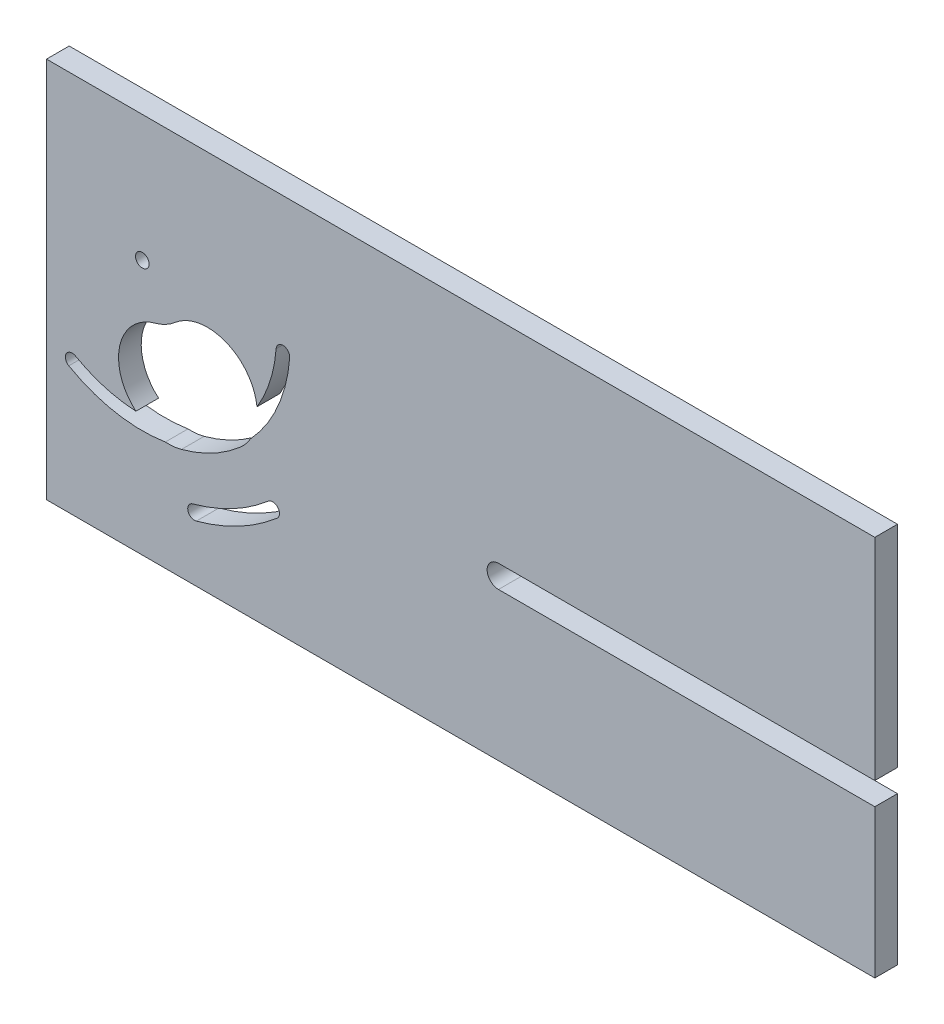
ISO-10303-21;
HEADER;
FILE_DESCRIPTION(('STEP AP214'),'2;1');
FILE_NAME('part.step','',(''),(''),'','','');
FILE_SCHEMA(('AUTOMOTIVE_DESIGN { 1 0 10303 214 1 1 1 1 }'));
ENDSEC;
DATA;
#1=APPLICATION_CONTEXT('core data for automotive mechanical design processes');
#2=APPLICATION_PROTOCOL_DEFINITION('international standard','automotive_design',2000,#1);
#3=PRODUCT_CONTEXT('',#1,'mechanical');
#4=PRODUCT('Part','Part','',(#3));
#5=PRODUCT_RELATED_PRODUCT_CATEGORY('part','',(#4));
#6=PRODUCT_DEFINITION_FORMATION('','',#4);
#7=PRODUCT_DEFINITION_CONTEXT('part definition',#1,'design');
#8=PRODUCT_DEFINITION('design','',#6,#7);
#9=PRODUCT_DEFINITION_SHAPE('','',#8);
#10=(LENGTH_UNIT() NAMED_UNIT(*) SI_UNIT(.MILLI.,.METRE.));
#11=(NAMED_UNIT(*) PLANE_ANGLE_UNIT() SI_UNIT($,.RADIAN.));
#12=(NAMED_UNIT(*) SI_UNIT($,.STERADIAN.) SOLID_ANGLE_UNIT());
#13=UNCERTAINTY_MEASURE_WITH_UNIT(LENGTH_MEASURE(1.E-05),#10,'distance_accuracy_value','');
#14=(GEOMETRIC_REPRESENTATION_CONTEXT(3) GLOBAL_UNCERTAINTY_ASSIGNED_CONTEXT((#13)) GLOBAL_UNIT_ASSIGNED_CONTEXT((#10,
#11,#12)) REPRESENTATION_CONTEXT('',''));
#15=CARTESIAN_POINT('',(0.,0.,0.));
#16=DIRECTION('',(0.,0.,1.));
#17=DIRECTION('',(1.,0.,0.));
#18=AXIS2_PLACEMENT_3D('',#15,#16,#17);
#19=CARTESIAN_POINT('',(8.34305319938463,-6.87375629455253,5.));
#20=DIRECTION('',(0.,0.,-1.));
#21=DIRECTION('',(-1.,0.,0.));
#22=AXIS2_PLACEMENT_3D('',#19,#20,#21);
#23=CYLINDRICAL_SURFACE('',#22,2.5);
#24=CARTESIAN_POINT('',(8.34305319938463,-6.87375629455253,0.));
#25=DIRECTION('',(0.,0.,1.));
#26=DIRECTION('',(1.,0.,0.));
#27=AXIS2_PLACEMENT_3D('',#24,#25,#26);
#28=CIRCLE('',#27,2.5);
#29=CARTESIAN_POINT('',(8.34305319938463,-4.37375629455253,0.));
#30=VERTEX_POINT('',#29);
#31=CARTESIAN_POINT('',(8.34305319938463,-9.37375629455253,0.));
#32=VERTEX_POINT('',#31);
#33=EDGE_CURVE('E335',#30,#32,#28,.T.);
#34=ORIENTED_EDGE('',*,*,#33,.F.);
#35=DIRECTION('',(0.,0.,-1.));
#36=VECTOR('',#35,1.);
#37=CARTESIAN_POINT('',(8.34305319938463,-4.37375629455253,5.));
#38=LINE('',#37,#36);
#39=CARTESIAN_POINT('',(8.34305319938463,-4.37375629455253,5.));
#40=VERTEX_POINT('',#39);
#41=EDGE_CURVE('E11',#40,#30,#38,.T.);
#42=ORIENTED_EDGE('',*,*,#41,.F.);
#43=CARTESIAN_POINT('',(8.34305319938463,-6.87375629455253,5.));
#44=DIRECTION('',(0.,0.,1.));
#45=DIRECTION('',(1.,0.,0.));
#46=AXIS2_PLACEMENT_3D('',#43,#44,#45);
#47=CIRCLE('',#46,2.5);
#48=CARTESIAN_POINT('',(8.34305319938463,-9.37375629455253,5.));
#49=VERTEX_POINT('',#48);
#50=EDGE_CURVE('E398',#40,#49,#47,.T.);
#51=ORIENTED_EDGE('',*,*,#50,.T.);
#52=DIRECTION('',(0.,0.,-1.));
#53=VECTOR('',#52,1.);
#54=CARTESIAN_POINT('',(8.34305319938463,-9.37375629455253,5.));
#55=LINE('',#54,#53);
#56=EDGE_CURVE('E56',#49,#32,#55,.T.);
#57=ORIENTED_EDGE('',*,*,#56,.T.);
#58=EDGE_LOOP('',(#34,#42,#51,#57));
#59=FACE_BOUND('',#58,.T.);
#60=ADVANCED_FACE('F37',(#59),#23,.F.);
#61=CARTESIAN_POINT('',(0.,-4.37375629455253,5.));
#62=DIRECTION('',(0.,1.,0.));
#63=DIRECTION('',(-1.,0.,0.));
#64=AXIS2_PLACEMENT_3D('',#61,#62,#63);
#65=PLANE('',#64);
#66=DIRECTION('',(1.,0.,0.));
#67=VECTOR('',#66,1.);
#68=CARTESIAN_POINT('',(0.,-4.37375629455253,0.));
#69=LINE('',#68,#67);
#70=CARTESIAN_POINT('',(91.35,-4.37375629455253,0.));
#71=VERTEX_POINT('',#70);
#72=EDGE_CURVE('E337',#30,#71,#69,.T.);
#73=ORIENTED_EDGE('',*,*,#72,.T.);
#74=DIRECTION('',(0.,0.,-1.));
#75=VECTOR('',#74,1.);
#76=CARTESIAN_POINT('',(91.35,-4.37375629455253,5.));
#77=LINE('',#76,#75);
#78=CARTESIAN_POINT('',(91.35,-4.37375629455253,5.));
#79=VERTEX_POINT('',#78);
#80=EDGE_CURVE('E47',#79,#71,#77,.T.);
#81=ORIENTED_EDGE('',*,*,#80,.F.);
#82=DIRECTION('',(1.,0.,0.));
#83=VECTOR('',#82,1.);
#84=CARTESIAN_POINT('',(0.,-4.37375629455253,5.));
#85=LINE('',#84,#83);
#86=EDGE_CURVE('E400',#40,#79,#85,.T.);
#87=ORIENTED_EDGE('',*,*,#86,.F.);
#88=ORIENTED_EDGE('',*,*,#41,.T.);
#89=EDGE_LOOP('',(#73,#81,#87,#88));
#90=FACE_BOUND('',#89,.T.);
#91=ADVANCED_FACE('F424',(#90),#65,.F.);
#92=CARTESIAN_POINT('',(91.35,0.,5.));
#93=DIRECTION('',(-1.,0.,0.));
#94=DIRECTION('',(0.,0.,1.));
#95=AXIS2_PLACEMENT_3D('',#92,#93,#94);
#96=PLANE('',#95);
#97=DIRECTION('',(0.,1.,0.));
#98=VECTOR('',#97,1.);
#99=CARTESIAN_POINT('',(91.35,0.,0.));
#100=LINE('',#99,#98);
#101=CARTESIAN_POINT('',(91.35,42.09,0.));
#102=VERTEX_POINT('',#101);
#103=EDGE_CURVE('E340',#71,#102,#100,.T.);
#104=ORIENTED_EDGE('',*,*,#103,.T.);
#105=DIRECTION('',(0.,0.,-1.));
#106=VECTOR('',#105,1.);
#107=CARTESIAN_POINT('',(91.35,42.09,5.));
#108=LINE('',#107,#106);
#109=CARTESIAN_POINT('',(91.35,42.09,5.));
#110=VERTEX_POINT('',#109);
#111=EDGE_CURVE('E238',#110,#102,#108,.T.);
#112=ORIENTED_EDGE('',*,*,#111,.F.);
#113=DIRECTION('',(0.,1.,0.));
#114=VECTOR('',#113,1.);
#115=CARTESIAN_POINT('',(91.35,0.,5.));
#116=LINE('',#115,#114);
#117=EDGE_CURVE('E216',#79,#110,#116,.T.);
#118=ORIENTED_EDGE('',*,*,#117,.F.);
#119=ORIENTED_EDGE('',*,*,#80,.T.);
#120=EDGE_LOOP('',(#104,#112,#118,#119));
#121=FACE_BOUND('',#120,.T.);
#122=ADVANCED_FACE('F429',(#121),#96,.F.);
#123=CARTESIAN_POINT('',(0.,42.09,5.));
#124=DIRECTION('',(0.,1.,0.));
#125=DIRECTION('',(0.,0.,1.));
#126=AXIS2_PLACEMENT_3D('',#123,#124,#125);
#127=PLANE('',#126);
#128=DIRECTION('',(1.,0.,0.));
#129=VECTOR('',#128,1.);
#130=CARTESIAN_POINT('',(0.,42.09,0.));
#131=LINE('',#130,#129);
#132=CARTESIAN_POINT('',(-91.35,42.09,0.));
#133=VERTEX_POINT('',#132);
#134=EDGE_CURVE('E343',#133,#102,#131,.T.);
#135=ORIENTED_EDGE('',*,*,#134,.F.);
#136=DIRECTION('',(0.,0.,-1.));
#137=VECTOR('',#136,1.);
#138=CARTESIAN_POINT('',(-91.35,42.09,5.));
#139=LINE('',#138,#137);
#140=CARTESIAN_POINT('',(-91.35,42.09,5.));
#141=VERTEX_POINT('',#140);
#142=EDGE_CURVE('E232',#141,#133,#139,.T.);
#143=ORIENTED_EDGE('',*,*,#142,.F.);
#144=DIRECTION('',(1.,0.,0.));
#145=VECTOR('',#144,1.);
#146=CARTESIAN_POINT('',(0.,42.09,5.));
#147=LINE('',#146,#145);
#148=EDGE_CURVE('E403',#141,#110,#147,.T.);
#149=ORIENTED_EDGE('',*,*,#148,.T.);
#150=ORIENTED_EDGE('',*,*,#111,.T.);
#151=EDGE_LOOP('',(#135,#143,#149,#150));
#152=FACE_BOUND('',#151,.T.);
#153=ADVANCED_FACE('F525',(#152),#127,.T.);
#154=CARTESIAN_POINT('',(-91.35,0.,5.));
#155=DIRECTION('',(-1.,0.,0.));
#156=DIRECTION('',(0.,0.,1.));
#157=AXIS2_PLACEMENT_3D('',#154,#155,#156);
#158=PLANE('',#157);
#159=DIRECTION('',(0.,1.,0.));
#160=VECTOR('',#159,1.);
#161=CARTESIAN_POINT('',(-91.35,0.,0.));
#162=LINE('',#161,#160);
#163=CARTESIAN_POINT('',(-91.35,-42.09,0.));
#164=VERTEX_POINT('',#163);
#165=EDGE_CURVE('E347',#164,#133,#162,.T.);
#166=ORIENTED_EDGE('',*,*,#165,.F.);
#167=DIRECTION('',(0.,0.,-1.));
#168=VECTOR('',#167,1.);
#169=CARTESIAN_POINT('',(-91.35,-42.09,5.));
#170=LINE('',#169,#168);
#171=CARTESIAN_POINT('',(-91.35,-42.09,5.));
#172=VERTEX_POINT('',#171);
#173=EDGE_CURVE('E230',#172,#164,#170,.T.);
#174=ORIENTED_EDGE('',*,*,#173,.F.);
#175=DIRECTION('',(0.,1.,0.));
#176=VECTOR('',#175,1.);
#177=CARTESIAN_POINT('',(-91.35,0.,5.));
#178=LINE('',#177,#176);
#179=EDGE_CURVE('E224',#172,#141,#178,.T.);
#180=ORIENTED_EDGE('',*,*,#179,.T.);
#181=ORIENTED_EDGE('',*,*,#142,.T.);
#182=EDGE_LOOP('',(#166,#174,#180,#181));
#183=FACE_BOUND('',#182,.T.);
#184=ADVANCED_FACE('F518',(#183),#158,.T.);
#185=CARTESIAN_POINT('',(0.,-42.09,5.));
#186=DIRECTION('',(0.,1.,0.));
#187=DIRECTION('',(0.,0.,1.));
#188=AXIS2_PLACEMENT_3D('',#185,#186,#187);
#189=PLANE('',#188);
#190=DIRECTION('',(1.,0.,0.));
#191=VECTOR('',#190,1.);
#192=CARTESIAN_POINT('',(0.,-42.09,0.));
#193=LINE('',#192,#191);
#194=CARTESIAN_POINT('',(91.35,-42.09,0.));
#195=VERTEX_POINT('',#194);
#196=EDGE_CURVE('E229',#164,#195,#193,.T.);
#197=ORIENTED_EDGE('',*,*,#196,.T.);
#198=DIRECTION('',(0.,0.,-1.));
#199=VECTOR('',#198,1.);
#200=CARTESIAN_POINT('',(91.35,-42.09,5.));
#201=LINE('',#200,#199);
#202=CARTESIAN_POINT('',(91.35,-42.09,5.));
#203=VERTEX_POINT('',#202);
#204=EDGE_CURVE('E209',#203,#195,#201,.T.);
#205=ORIENTED_EDGE('',*,*,#204,.F.);
#206=DIRECTION('',(1.,0.,0.));
#207=VECTOR('',#206,1.);
#208=CARTESIAN_POINT('',(0.,-42.09,5.));
#209=LINE('',#208,#207);
#210=EDGE_CURVE('E214',#172,#203,#209,.T.);
#211=ORIENTED_EDGE('',*,*,#210,.F.);
#212=ORIENTED_EDGE('',*,*,#173,.T.);
#213=EDGE_LOOP('',(#197,#205,#211,#212));
#214=FACE_BOUND('',#213,.T.);
#215=ADVANCED_FACE('F227',(#214),#189,.F.);
#216=CARTESIAN_POINT('',(91.35,-9.37375629455253,0.));
#217=VERTEX_POINT('',#216);
#218=EDGE_CURVE('E344',#195,#217,#100,.T.);
#219=ORIENTED_EDGE('',*,*,#218,.T.);
#220=DIRECTION('',(0.,0.,-1.));
#221=VECTOR('',#220,1.);
#222=CARTESIAN_POINT('',(91.35,-9.37375629455253,5.));
#223=LINE('',#222,#221);
#224=CARTESIAN_POINT('',(91.35,-9.37375629455253,5.));
#225=VERTEX_POINT('',#224);
#226=EDGE_CURVE('E130',#225,#217,#223,.T.);
#227=ORIENTED_EDGE('',*,*,#226,.F.);
#228=EDGE_CURVE('E205',#203,#225,#116,.T.);
#229=ORIENTED_EDGE('',*,*,#228,.F.);
#230=ORIENTED_EDGE('',*,*,#204,.T.);
#231=EDGE_LOOP('',(#219,#227,#229,#230));
#232=FACE_BOUND('',#231,.T.);
#233=ADVANCED_FACE('F207',(#232),#96,.F.);
#234=CARTESIAN_POINT('',(-58.7017747285603,-28.1953691451832,5.));
#235=DIRECTION('',(0.,0.,-1.));
#236=DIRECTION('',(-1.,0.,0.));
#237=AXIS2_PLACEMENT_3D('',#234,#235,#236);
#238=CYLINDRICAL_SURFACE('',#237,1.49999999999994);
#239=CARTESIAN_POINT('',(-58.7017747285603,-28.1953691451832,0.));
#240=DIRECTION('',(0.,0.,1.));
#241=DIRECTION('',(1.,0.,0.));
#242=AXIS2_PLACEMENT_3D('',#239,#240,#241);
#243=CIRCLE('',#242,1.49999999999994);
#244=CARTESIAN_POINT('',(-59.0947234892787,-26.7477534256465,0.));
#245=VERTEX_POINT('',#244);
#246=CARTESIAN_POINT('',(-58.3088259678419,-29.64298486472,0.));
#247=VERTEX_POINT('',#246);
#248=EDGE_CURVE('E323',#245,#247,#243,.T.);
#249=ORIENTED_EDGE('',*,*,#248,.F.);
#250=DIRECTION('',(0.,0.,-1.));
#251=VECTOR('',#250,1.);
#252=CARTESIAN_POINT('',(-59.0947234892787,-26.7477534256465,5.));
#253=LINE('',#252,#251);
#254=CARTESIAN_POINT('',(-59.0947234892787,-26.7477534256465,5.));
#255=VERTEX_POINT('',#254);
#256=EDGE_CURVE('E248',#255,#245,#253,.T.);
#257=ORIENTED_EDGE('',*,*,#256,.F.);
#258=CARTESIAN_POINT('',(-58.7017747285603,-28.1953691451832,5.));
#259=DIRECTION('',(0.,0.,1.));
#260=DIRECTION('',(1.,0.,0.));
#261=AXIS2_PLACEMENT_3D('',#258,#259,#260);
#262=CIRCLE('',#261,1.49999999999994);
#263=CARTESIAN_POINT('',(-58.3088259678419,-29.64298486472,5.));
#264=VERTEX_POINT('',#263);
#265=EDGE_CURVE('E387',#255,#264,#262,.T.);
#266=ORIENTED_EDGE('',*,*,#265,.T.);
#267=DIRECTION('',(0.,0.,-1.));
#268=VECTOR('',#267,1.);
#269=CARTESIAN_POINT('',(-58.3088259678419,-29.64298486472,5.));
#270=LINE('',#269,#268);
#271=EDGE_CURVE('E242',#264,#247,#270,.T.);
#272=ORIENTED_EDGE('',*,*,#271,.T.);
#273=EDGE_LOOP('',(#249,#257,#266,#272));
#274=FACE_BOUND('',#273,.T.);
#275=ADVANCED_FACE('F446',(#274),#238,.F.);
#276=CARTESIAN_POINT('',(-70.2235672720057,14.2506942363108,5.));
#277=DIRECTION('',(0.,0.,-1.));
#278=DIRECTION('',(-1.,0.,0.));
#279=AXIS2_PLACEMENT_3D('',#276,#277,#278);
#280=CYLINDRICAL_SURFACE('',#279,42.4820417898032);
#281=CARTESIAN_POINT('',(-70.2235672720057,14.2506942363108,0.));
#282=DIRECTION('',(0.,0.,1.));
#283=DIRECTION('',(1.,0.,0.));
#284=AXIS2_PLACEMENT_3D('',#281,#282,#283);
#285=CIRCLE('',#284,42.4820417898032);
#286=CARTESIAN_POINT('',(-42.4512097179492,-17.8961567839715,0.));
#287=VERTEX_POINT('',#286);
#288=EDGE_CURVE('E326',#245,#287,#285,.T.);
#289=ORIENTED_EDGE('',*,*,#288,.T.);
#290=DIRECTION('',(0.,0.,-1.));
#291=VECTOR('',#290,1.);
#292=CARTESIAN_POINT('',(-42.4512097179492,-17.8961567839715,5.));
#293=LINE('',#292,#291);
#294=CARTESIAN_POINT('',(-42.4512097179492,-17.8961567839715,5.));
#295=VERTEX_POINT('',#294);
#296=EDGE_CURVE('E246',#295,#287,#293,.T.);
#297=ORIENTED_EDGE('',*,*,#296,.F.);
#298=CARTESIAN_POINT('',(-70.2235672720057,14.2506942363108,5.));
#299=DIRECTION('',(0.,0.,1.));
#300=DIRECTION('',(1.,0.,0.));
#301=AXIS2_PLACEMENT_3D('',#298,#299,#300);
#302=CIRCLE('',#301,42.4820417898032);
#303=EDGE_CURVE('E390',#255,#295,#302,.T.);
#304=ORIENTED_EDGE('',*,*,#303,.F.);
#305=ORIENTED_EDGE('',*,*,#256,.T.);
#306=EDGE_LOOP('',(#289,#297,#304,#305));
#307=FACE_BOUND('',#306,.T.);
#308=ADVANCED_FACE('F442',(#307),#280,.T.);
#309=CARTESIAN_POINT('',(-41.4705945079456,-19.0312311471345,5.));
#310=DIRECTION('',(0.,0.,-1.));
#311=DIRECTION('',(-1.,0.,0.));
#312=AXIS2_PLACEMENT_3D('',#309,#310,#311);
#313=CYLINDRICAL_SURFACE('',#312,1.5);
#314=CARTESIAN_POINT('',(-41.4705945079456,-19.0312311471345,0.));
#315=DIRECTION('',(0.,0.,1.));
#316=DIRECTION('',(1.,0.,0.));
#317=AXIS2_PLACEMENT_3D('',#314,#315,#316);
#318=CIRCLE('',#317,1.5);
#319=CARTESIAN_POINT('',(-40.4899792979421,-20.1663055102974,0.));
#320=VERTEX_POINT('',#319);
#321=EDGE_CURVE('E329',#320,#287,#318,.T.);
#322=ORIENTED_EDGE('',*,*,#321,.F.);
#323=DIRECTION('',(0.,0.,-1.));
#324=VECTOR('',#323,1.);
#325=CARTESIAN_POINT('',(-40.4899792979421,-20.1663055102974,5.));
#326=LINE('',#325,#324);
#327=CARTESIAN_POINT('',(-40.4899792979421,-20.1663055102974,5.));
#328=VERTEX_POINT('',#327);
#329=EDGE_CURVE('E244',#328,#320,#326,.T.);
#330=ORIENTED_EDGE('',*,*,#329,.F.);
#331=CARTESIAN_POINT('',(-41.4705945079456,-19.0312311471345,5.));
#332=DIRECTION('',(0.,0.,1.));
#333=DIRECTION('',(1.,0.,0.));
#334=AXIS2_PLACEMENT_3D('',#331,#332,#333);
#335=CIRCLE('',#334,1.5);
#336=EDGE_CURVE('E392',#328,#295,#335,.T.);
#337=ORIENTED_EDGE('',*,*,#336,.T.);
#338=ORIENTED_EDGE('',*,*,#296,.T.);
#339=EDGE_LOOP('',(#322,#330,#337,#338));
#340=FACE_BOUND('',#339,.T.);
#341=ADVANCED_FACE('F439',(#340),#313,.F.);
#342=CARTESIAN_POINT('',(-64.462671000283,-6.97233745443623,5.));
#343=DIRECTION('',(0.,0.,-1.));
#344=DIRECTION('',(-1.,0.,0.));
#345=AXIS2_PLACEMENT_3D('',#342,#343,#344);
#346=CYLINDRICAL_SURFACE('',#345,11.);
#347=CARTESIAN_POINT('',(-64.462671000283,-6.97233745443623,0.));
#348=DIRECTION('',(0.,0.,1.));
#349=DIRECTION('',(1.,0.,0.));
#350=AXIS2_PLACEMENT_3D('',#347,#348,#349);
#351=CIRCLE('',#350,11.);
#352=CARTESIAN_POINT('',(-65.144358521498,-17.9511945043946,0.));
#353=VERTEX_POINT('',#352);
#354=CARTESIAN_POINT('',(-61.5810467550147,-17.5881860643723,0.));
#355=VERTEX_POINT('',#354);
#356=EDGE_CURVE('E286',#353,#355,#351,.T.);
#357=ORIENTED_EDGE('',*,*,#356,.F.);
#358=DIRECTION('',(0.,0.,-1.));
#359=VECTOR('',#358,1.);
#360=CARTESIAN_POINT('',(-65.144358521498,-17.9511945043946,5.));
#361=LINE('',#360,#359);
#362=CARTESIAN_POINT('',(-65.144358521498,-17.9511945043946,5.));
#363=VERTEX_POINT('',#362);
#364=EDGE_CURVE('E41',#363,#353,#361,.T.);
#365=ORIENTED_EDGE('',*,*,#364,.F.);
#366=CARTESIAN_POINT('',(-64.462671000283,-6.97233745443623,5.));
#367=DIRECTION('',(0.,0.,1.));
#368=DIRECTION('',(1.,0.,0.));
#369=AXIS2_PLACEMENT_3D('',#366,#367,#368);
#370=CIRCLE('',#369,11.);
#371=CARTESIAN_POINT('',(-61.5810467550147,-17.5881860643723,5.));
#372=VERTEX_POINT('',#371);
#373=EDGE_CURVE('E356',#363,#372,#370,.T.);
#374=ORIENTED_EDGE('',*,*,#373,.T.);
#375=DIRECTION('',(0.,0.,-1.));
#376=VECTOR('',#375,1.);
#377=CARTESIAN_POINT('',(-61.5810467550147,-17.5881860643723,5.));
#378=LINE('',#377,#376);
#379=EDGE_CURVE('E250',#372,#355,#378,.T.);
#380=ORIENTED_EDGE('',*,*,#379,.T.);
#381=EDGE_LOOP('',(#357,#365,#374,#380));
#382=FACE_BOUND('',#381,.T.);
#383=ADVANCED_FACE('F39',(#382),#346,.F.);
#384=CARTESIAN_POINT('',(-70.2235672720057,14.2506942363108,5.));
#385=DIRECTION('',(0.,0.,-1.));
#386=DIRECTION('',(-1.,0.,0.));
#387=AXIS2_PLACEMENT_3D('',#384,#385,#386);
#388=CYLINDRICAL_SURFACE('',#387,32.6);
#389=CARTESIAN_POINT('',(-70.2235672720057,14.2506942363108,0.));
#390=DIRECTION('',(0.,0.,1.));
#391=DIRECTION('',(1.,0.,0.));
#392=AXIS2_PLACEMENT_3D('',#389,#390,#391);
#393=CIRCLE('',#392,32.6);
#394=CARTESIAN_POINT('',(-86.4314648495039,-14.0347093513584,0.));
#395=VERTEX_POINT('',#394);
#396=EDGE_CURVE('E281',#395,#353,#393,.T.);
#397=ORIENTED_EDGE('',*,*,#396,.F.);
#398=DIRECTION('',(0.,0.,-1.));
#399=VECTOR('',#398,1.);
#400=CARTESIAN_POINT('',(-86.4314648495039,-14.0347093513584,5.));
#401=LINE('',#400,#399);
#402=CARTESIAN_POINT('',(-86.4314648495039,-14.0347093513584,5.));
#403=VERTEX_POINT('',#402);
#404=EDGE_CURVE('E272',#403,#395,#401,.T.);
#405=ORIENTED_EDGE('',*,*,#404,.F.);
#406=CARTESIAN_POINT('',(-70.2235672720057,14.2506942363108,5.));
#407=DIRECTION('',(0.,0.,1.));
#408=DIRECTION('',(1.,0.,0.));
#409=AXIS2_PLACEMENT_3D('',#406,#407,#408);
#410=CIRCLE('',#409,32.6);
#411=EDGE_CURVE('E284',#403,#363,#410,.T.);
#412=ORIENTED_EDGE('',*,*,#411,.T.);
#413=ORIENTED_EDGE('',*,*,#364,.T.);
#414=EDGE_LOOP('',(#397,#405,#412,#413));
#415=FACE_BOUND('',#414,.T.);
#416=ADVANCED_FACE('F279',(#415),#388,.F.);
#417=CARTESIAN_POINT('',(-85.6857026910301,-12.7332337261589,5.));
#418=DIRECTION('',(0.,0.,-1.));
#419=DIRECTION('',(-1.,0.,0.));
#420=AXIS2_PLACEMENT_3D('',#417,#418,#419);
#421=CYLINDRICAL_SURFACE('',#420,1.49999999999997);
#422=CARTESIAN_POINT('',(-85.6857026910301,-12.7332337261589,0.));
#423=DIRECTION('',(0.,0.,1.));
#424=DIRECTION('',(1.,0.,0.));
#425=AXIS2_PLACEMENT_3D('',#422,#423,#424);
#426=CIRCLE('',#425,1.49999999999997);
#427=CARTESIAN_POINT('',(-84.9399405325562,-11.4317581009594,0.));
#428=VERTEX_POINT('',#427);
#429=EDGE_CURVE('E294',#428,#395,#426,.T.);
#430=ORIENTED_EDGE('',*,*,#429,.F.);
#431=DIRECTION('',(0.,0.,-1.));
#432=VECTOR('',#431,1.);
#433=CARTESIAN_POINT('',(-84.9399405325562,-11.4317581009594,5.));
#434=LINE('',#433,#432);
#435=CARTESIAN_POINT('',(-84.9399405325562,-11.4317581009594,5.));
#436=VERTEX_POINT('',#435);
#437=EDGE_CURVE('E271',#436,#428,#434,.T.);
#438=ORIENTED_EDGE('',*,*,#437,.F.);
#439=CARTESIAN_POINT('',(-85.6857026910301,-12.7332337261589,5.));
#440=DIRECTION('',(0.,0.,1.));
#441=DIRECTION('',(1.,0.,0.));
#442=AXIS2_PLACEMENT_3D('',#439,#440,#441);
#443=CIRCLE('',#442,1.49999999999997);
#444=EDGE_CURVE('E361',#436,#403,#443,.T.);
#445=ORIENTED_EDGE('',*,*,#444,.T.);
#446=ORIENTED_EDGE('',*,*,#404,.T.);
#447=EDGE_LOOP('',(#430,#438,#445,#446));
#448=FACE_BOUND('',#447,.T.);
#449=ADVANCED_FACE('F485',(#448),#421,.F.);
#450=CARTESIAN_POINT('',(-70.2235672720057,14.2506942363108,5.));
#451=DIRECTION('',(0.,0.,-1.));
#452=DIRECTION('',(-1.,0.,0.));
#453=AXIS2_PLACEMENT_3D('',#450,#451,#452);
#454=CYLINDRICAL_SURFACE('',#453,29.6);
#455=CARTESIAN_POINT('',(-70.2235672720057,14.2506942363108,0.));
#456=DIRECTION('',(0.,0.,1.));
#457=DIRECTION('',(1.,0.,0.));
#458=AXIS2_PLACEMENT_3D('',#455,#456,#457);
#459=CIRCLE('',#458,29.6);
#460=CARTESIAN_POINT('',(-71.6310926148158,-15.3158218318591,0.));
#461=VERTEX_POINT('',#460);
#462=EDGE_CURVE('E296',#428,#461,#459,.T.);
#463=ORIENTED_EDGE('',*,*,#462,.T.);
#464=DIRECTION('',(0.,0.,-1.));
#465=VECTOR('',#464,1.);
#466=CARTESIAN_POINT('',(-71.6310926148158,-15.3158218318591,5.));
#467=LINE('',#466,#465);
#468=CARTESIAN_POINT('',(-71.6310926148158,-15.3158218318591,5.));
#469=VERTEX_POINT('',#468);
#470=EDGE_CURVE('E269',#469,#461,#467,.T.);
#471=ORIENTED_EDGE('',*,*,#470,.F.);
#472=CARTESIAN_POINT('',(-70.2235672720057,14.2506942363108,5.));
#473=DIRECTION('',(0.,0.,1.));
#474=DIRECTION('',(1.,0.,0.));
#475=AXIS2_PLACEMENT_3D('',#472,#473,#474);
#476=CIRCLE('',#475,29.6);
#477=EDGE_CURVE('E365',#436,#469,#476,.T.);
#478=ORIENTED_EDGE('',*,*,#477,.F.);
#479=ORIENTED_EDGE('',*,*,#437,.T.);
#480=EDGE_LOOP('',(#463,#471,#478,#479));
#481=FACE_BOUND('',#480,.T.);
#482=ADVANCED_FACE('F481',(#481),#454,.T.);
#483=CARTESIAN_POINT('',(-64.462671000283,-6.97233745443623,5.));
#484=DIRECTION('',(0.,0.,-1.));
#485=DIRECTION('',(-1.,0.,0.));
#486=AXIS2_PLACEMENT_3D('',#483,#484,#485);
#487=CYLINDRICAL_SURFACE('',#486,11.);
#488=CARTESIAN_POINT('',(-64.462671000283,-6.97233745443623,0.));
#489=DIRECTION('',(0.,0.,1.));
#490=DIRECTION('',(1.,0.,0.));
#491=AXIS2_PLACEMENT_3D('',#488,#489,#490);
#492=CIRCLE('',#491,11.);
#493=CARTESIAN_POINT('',(-67.3442952455513,3.64351115549986,0.));
#494=VERTEX_POINT('',#493);
#495=EDGE_CURVE('E302',#494,#461,#492,.T.);
#496=ORIENTED_EDGE('',*,*,#495,.F.);
#497=DIRECTION('',(0.,0.,-1.));
#498=VECTOR('',#497,1.);
#499=CARTESIAN_POINT('',(-67.3442952455513,3.64351115549986,5.));
#500=LINE('',#499,#498);
#501=CARTESIAN_POINT('',(-67.3442952455513,3.64351115549986,5.));
#502=VERTEX_POINT('',#501);
#503=EDGE_CURVE('E267',#502,#494,#500,.T.);
#504=ORIENTED_EDGE('',*,*,#503,.F.);
#505=CARTESIAN_POINT('',(-64.462671000283,-6.97233745443623,5.));
#506=DIRECTION('',(0.,0.,1.));
#507=DIRECTION('',(1.,0.,0.));
#508=AXIS2_PLACEMENT_3D('',#505,#506,#507);
#509=CIRCLE('',#508,11.);
#510=EDGE_CURVE('E367',#502,#469,#509,.T.);
#511=ORIENTED_EDGE('',*,*,#510,.T.);
#512=ORIENTED_EDGE('',*,*,#470,.T.);
#513=EDGE_LOOP('',(#496,#504,#511,#512));
#514=FACE_BOUND('',#513,.T.);
#515=ADVANCED_FACE('F477',(#514),#487,.F.);
#516=CARTESIAN_POINT('',(-70.2235672720057,14.2506942363108,5.));
#517=DIRECTION('',(0.,0.,-1.));
#518=DIRECTION('',(-1.,0.,0.));
#519=AXIS2_PLACEMENT_3D('',#516,#517,#518);
#520=CYLINDRICAL_SURFACE('',#519,10.9910208949016);
#521=CARTESIAN_POINT('',(-70.2235672720057,14.2506942363108,0.));
#522=DIRECTION('',(0.,0.,1.));
#523=DIRECTION('',(1.,0.,0.));
#524=AXIS2_PLACEMENT_3D('',#521,#522,#523);
#525=CIRCLE('',#524,10.9910208949016);
#526=CARTESIAN_POINT('',(-63.0382590966679,5.93361020778323,0.));
#527=VERTEX_POINT('',#526);
#528=EDGE_CURVE('E305',#494,#527,#525,.T.);
#529=ORIENTED_EDGE('',*,*,#528,.T.);
#530=DIRECTION('',(0.,0.,-1.));
#531=VECTOR('',#530,1.);
#532=CARTESIAN_POINT('',(-63.0382590966679,5.93361020778323,5.));
#533=LINE('',#532,#531);
#534=CARTESIAN_POINT('',(-63.0382590966679,5.93361020778323,5.));
#535=VERTEX_POINT('',#534);
#536=EDGE_CURVE('E264',#535,#527,#533,.T.);
#537=ORIENTED_EDGE('',*,*,#536,.F.);
#538=CARTESIAN_POINT('',(-70.2235672720057,14.2506942363108,5.));
#539=DIRECTION('',(0.,0.,1.));
#540=DIRECTION('',(1.,0.,0.));
#541=AXIS2_PLACEMENT_3D('',#538,#539,#540);
#542=CIRCLE('',#541,10.9910208949016);
#543=EDGE_CURVE('E370',#502,#535,#542,.T.);
#544=ORIENTED_EDGE('',*,*,#543,.F.);
#545=ORIENTED_EDGE('',*,*,#503,.T.);
#546=EDGE_LOOP('',(#529,#537,#544,#545));
#547=FACE_BOUND('',#546,.T.);
#548=ADVANCED_FACE('F473',(#547),#520,.T.);
#549=CARTESIAN_POINT('',(-55.8470808899757,-2.39026845541186,5.));
#550=DIRECTION('',(0.,0.,-1.));
#551=DIRECTION('',(-1.,0.,0.));
#552=AXIS2_PLACEMENT_3D('',#549,#550,#551);
#553=CYLINDRICAL_SURFACE('',#552,11.);
#554=CARTESIAN_POINT('',(-55.8470808899757,-2.39026845541186,0.));
#555=DIRECTION('',(0.,0.,1.));
#556=DIRECTION('',(1.,0.,0.));
#557=AXIS2_PLACEMENT_3D('',#554,#555,#556);
#558=CIRCLE('',#557,11.);
#559=CARTESIAN_POINT('',(-44.9217378472609,-1.11086257805919,0.));
#560=VERTEX_POINT('',#559);
#561=EDGE_CURVE('E307',#527,#560,#558,.F.);
#562=ORIENTED_EDGE('',*,*,#561,.T.);
#563=DIRECTION('',(0.,0.,-1.));
#564=VECTOR('',#563,1.);
#565=CARTESIAN_POINT('',(-44.9217378472609,-1.11086257805919,5.));
#566=LINE('',#565,#564);
#567=CARTESIAN_POINT('',(-44.9217378472609,-1.11086257805919,5.));
#568=VERTEX_POINT('',#567);
#569=EDGE_CURVE('E261',#568,#560,#566,.T.);
#570=ORIENTED_EDGE('',*,*,#569,.F.);
#571=CARTESIAN_POINT('',(-55.8470808899757,-2.39026845541186,5.));
#572=DIRECTION('',(0.,0.,1.));
#573=DIRECTION('',(1.,0.,0.));
#574=AXIS2_PLACEMENT_3D('',#571,#572,#573);
#575=CIRCLE('',#574,11.);
#576=EDGE_CURVE('E372',#535,#568,#575,.F.);
#577=ORIENTED_EDGE('',*,*,#576,.F.);
#578=ORIENTED_EDGE('',*,*,#536,.T.);
#579=EDGE_LOOP('',(#562,#570,#577,#578));
#580=FACE_BOUND('',#579,.T.);
#581=ADVANCED_FACE('F469',(#580),#553,.F.);
#582=CARTESIAN_POINT('',(-70.2235672720057,14.2506942363108,5.));
#583=DIRECTION('',(0.,0.,-1.));
#584=DIRECTION('',(-1.,0.,0.));
#585=AXIS2_PLACEMENT_3D('',#582,#583,#584);
#586=CYLINDRICAL_SURFACE('',#585,29.6);
#587=CARTESIAN_POINT('',(-70.2235672720057,14.2506942363108,0.));
#588=DIRECTION('',(0.,0.,1.));
#589=DIRECTION('',(1.,0.,0.));
#590=AXIS2_PLACEMENT_3D('',#587,#588,#589);
#591=CIRCLE('',#590,29.6);
#592=CARTESIAN_POINT('',(-40.7021366423247,12.0954370412336,0.));
#593=VERTEX_POINT('',#592);
#594=EDGE_CURVE('E309',#560,#593,#591,.T.);
#595=ORIENTED_EDGE('',*,*,#594,.T.);
#596=DIRECTION('',(0.,0.,-1.));
#597=VECTOR('',#596,1.);
#598=CARTESIAN_POINT('',(-40.7021366423247,12.0954370412336,5.));
#599=LINE('',#598,#597);
#600=CARTESIAN_POINT('',(-40.7021366423247,12.0954370412336,5.));
#601=VERTEX_POINT('',#600);
#602=EDGE_CURVE('E259',#601,#593,#599,.T.);
#603=ORIENTED_EDGE('',*,*,#602,.F.);
#604=CARTESIAN_POINT('',(-70.2235672720057,14.2506942363108,5.));
#605=DIRECTION('',(0.,0.,1.));
#606=DIRECTION('',(1.,0.,0.));
#607=AXIS2_PLACEMENT_3D('',#604,#605,#606);
#608=CIRCLE('',#607,29.6);
#609=EDGE_CURVE('E374',#568,#601,#608,.T.);
#610=ORIENTED_EDGE('',*,*,#609,.F.);
#611=ORIENTED_EDGE('',*,*,#569,.T.);
#612=EDGE_LOOP('',(#595,#603,#610,#611));
#613=FACE_BOUND('',#612,.T.);
#614=ADVANCED_FACE('F465',(#613),#586,.T.);
#615=CARTESIAN_POINT('',(-39.2061181982531,11.9862179266182,5.));
#616=DIRECTION('',(0.,0.,-1.));
#617=DIRECTION('',(-1.,0.,0.));
#618=AXIS2_PLACEMENT_3D('',#615,#616,#617);
#619=CYLINDRICAL_SURFACE('',#618,1.49999999999997);
#620=CARTESIAN_POINT('',(-39.2061181982531,11.9862179266182,0.));
#621=DIRECTION('',(0.,0.,1.));
#622=DIRECTION('',(1.,0.,0.));
#623=AXIS2_PLACEMENT_3D('',#620,#621,#622);
#624=CIRCLE('',#623,1.49999999999997);
#625=CARTESIAN_POINT('',(-37.7100997541814,11.8769988120028,0.));
#626=VERTEX_POINT('',#625);
#627=EDGE_CURVE('E312',#626,#593,#624,.T.);
#628=ORIENTED_EDGE('',*,*,#627,.F.);
#629=DIRECTION('',(0.,0.,-1.));
#630=VECTOR('',#629,1.);
#631=CARTESIAN_POINT('',(-37.7100997541814,11.8769988120028,5.));
#632=LINE('',#631,#630);
#633=CARTESIAN_POINT('',(-37.7100997541814,11.8769988120028,5.));
#634=VERTEX_POINT('',#633);
#635=EDGE_CURVE('E257',#634,#626,#632,.T.);
#636=ORIENTED_EDGE('',*,*,#635,.F.);
#637=CARTESIAN_POINT('',(-39.2061181982531,11.9862179266182,5.));
#638=DIRECTION('',(0.,0.,1.));
#639=DIRECTION('',(1.,0.,0.));
#640=AXIS2_PLACEMENT_3D('',#637,#638,#639);
#641=CIRCLE('',#640,1.49999999999997);
#642=EDGE_CURVE('E376',#634,#601,#641,.T.);
#643=ORIENTED_EDGE('',*,*,#642,.T.);
#644=ORIENTED_EDGE('',*,*,#602,.T.);
#645=EDGE_LOOP('',(#628,#636,#643,#644));
#646=FACE_BOUND('',#645,.T.);
#647=ADVANCED_FACE('F461',(#646),#619,.F.);
#648=CARTESIAN_POINT('',(-70.2235672720057,14.2506942363108,5.));
#649=DIRECTION('',(0.,0.,-1.));
#650=DIRECTION('',(-1.,0.,0.));
#651=AXIS2_PLACEMENT_3D('',#648,#649,#650);
#652=CYLINDRICAL_SURFACE('',#651,32.6);
#653=CARTESIAN_POINT('',(-70.2235672720057,14.2506942363108,0.));
#654=DIRECTION('',(0.,0.,1.));
#655=DIRECTION('',(1.,0.,0.));
#656=AXIS2_PLACEMENT_3D('',#653,#654,#655);
#657=CIRCLE('',#656,32.6);
#658=CARTESIAN_POINT('',(-46.362913364221,-7.96257195965676,0.));
#659=VERTEX_POINT('',#658);
#660=EDGE_CURVE('E315',#659,#626,#657,.T.);
#661=ORIENTED_EDGE('',*,*,#660,.F.);
#662=DIRECTION('',(0.,0.,-1.));
#663=VECTOR('',#662,1.);
#664=CARTESIAN_POINT('',(-46.362913364221,-7.96257195965676,5.));
#665=LINE('',#664,#663);
#666=CARTESIAN_POINT('',(-46.362913364221,-7.96257195965676,5.));
#667=VERTEX_POINT('',#666);
#668=EDGE_CURVE('E255',#667,#659,#665,.T.);
#669=ORIENTED_EDGE('',*,*,#668,.F.);
#670=CARTESIAN_POINT('',(-70.2235672720057,14.2506942363108,5.));
#671=DIRECTION('',(0.,0.,1.));
#672=DIRECTION('',(1.,0.,0.));
#673=AXIS2_PLACEMENT_3D('',#670,#671,#672);
#674=CIRCLE('',#673,32.6);
#675=EDGE_CURVE('E379',#667,#634,#674,.T.);
#676=ORIENTED_EDGE('',*,*,#675,.T.);
#677=ORIENTED_EDGE('',*,*,#635,.T.);
#678=EDGE_LOOP('',(#661,#669,#676,#677));
#679=FACE_BOUND('',#678,.T.);
#680=ADVANCED_FACE('F457',(#679),#652,.F.);
#681=CARTESIAN_POINT('',(-55.8470808899757,-2.39026845541186,5.));
#682=DIRECTION('',(0.,0.,-1.));
#683=DIRECTION('',(-1.,0.,0.));
#684=AXIS2_PLACEMENT_3D('',#681,#682,#683);
#685=CYLINDRICAL_SURFACE('',#684,11.);
#686=CARTESIAN_POINT('',(-55.8470808899757,-2.39026845541186,0.));
#687=DIRECTION('',(0.,0.,1.));
#688=DIRECTION('',(1.,0.,0.));
#689=AXIS2_PLACEMENT_3D('',#686,#687,#688);
#690=CIRCLE('',#689,11.);
#691=CARTESIAN_POINT('',(-48.6559026832834,-10.714147118607,0.));
#692=VERTEX_POINT('',#691);
#693=EDGE_CURVE('E318',#659,#692,#690,.F.);
#694=ORIENTED_EDGE('',*,*,#693,.T.);
#695=DIRECTION('',(0.,0.,-1.));
#696=VECTOR('',#695,1.);
#697=CARTESIAN_POINT('',(-48.6559026832834,-10.714147118607,5.));
#698=LINE('',#697,#696);
#699=CARTESIAN_POINT('',(-48.6559026832834,-10.714147118607,5.));
#700=VERTEX_POINT('',#699);
#701=EDGE_CURVE('E252',#700,#692,#698,.T.);
#702=ORIENTED_EDGE('',*,*,#701,.F.);
#703=CARTESIAN_POINT('',(-55.8470808899757,-2.39026845541186,5.));
#704=DIRECTION('',(0.,0.,1.));
#705=DIRECTION('',(1.,0.,0.));
#706=AXIS2_PLACEMENT_3D('',#703,#704,#705);
#707=CIRCLE('',#706,11.);
#708=EDGE_CURVE('E382',#667,#700,#707,.F.);
#709=ORIENTED_EDGE('',*,*,#708,.F.);
#710=ORIENTED_EDGE('',*,*,#668,.T.);
#711=EDGE_LOOP('',(#694,#702,#709,#710));
#712=FACE_BOUND('',#711,.T.);
#713=ADVANCED_FACE('F454',(#712),#685,.F.);
#714=CARTESIAN_POINT('',(0.,-9.37375629455253,5.));
#715=DIRECTION('',(0.,1.,0.));
#716=DIRECTION('',(0.,0.,1.));
#717=AXIS2_PLACEMENT_3D('',#714,#715,#716);
#718=PLANE('',#717);
#719=DIRECTION('',(1.,0.,0.));
#720=VECTOR('',#719,1.);
#721=CARTESIAN_POINT('',(0.,-9.37375629455253,0.));
#722=LINE('',#721,#720);
#723=EDGE_CURVE('E351',#32,#217,#722,.T.);
#724=ORIENTED_EDGE('',*,*,#723,.F.);
#725=ORIENTED_EDGE('',*,*,#56,.F.);
#726=DIRECTION('',(1.,0.,0.));
#727=VECTOR('',#726,1.);
#728=CARTESIAN_POINT('',(0.,-9.37375629455253,5.));
#729=LINE('',#728,#727);
#730=EDGE_CURVE('E213',#49,#225,#729,.T.);
#731=ORIENTED_EDGE('',*,*,#730,.T.);
#732=ORIENTED_EDGE('',*,*,#226,.T.);
#733=EDGE_LOOP('',(#724,#725,#731,#732));
#734=FACE_BOUND('',#733,.T.);
#735=ADVANCED_FACE('F437',(#734),#718,.T.);
#736=CARTESIAN_POINT('',(-70.2235672720057,14.2506942363108,5.));
#737=DIRECTION('',(0.,0.,-1.));
#738=DIRECTION('',(-1.,0.,0.));
#739=AXIS2_PLACEMENT_3D('',#736,#737,#738);
#740=CYLINDRICAL_SURFACE('',#739,45.4820417898032);
#741=CARTESIAN_POINT('',(-70.2235672720057,14.2506942363108,0.));
#742=DIRECTION('',(0.,0.,1.));
#743=DIRECTION('',(1.,0.,0.));
#744=AXIS2_PLACEMENT_3D('',#741,#742,#743);
#745=CIRCLE('',#744,45.4820417898032);
#746=EDGE_CURVE('E332',#247,#320,#745,.T.);
#747=ORIENTED_EDGE('',*,*,#746,.F.);
#748=ORIENTED_EDGE('',*,*,#271,.F.);
#749=CARTESIAN_POINT('',(-70.2235672720057,14.2506942363108,5.));
#750=DIRECTION('',(0.,0.,1.));
#751=DIRECTION('',(1.,0.,0.));
#752=AXIS2_PLACEMENT_3D('',#749,#750,#751);
#753=CIRCLE('',#752,45.4820417898032);
#754=EDGE_CURVE('E395',#264,#328,#753,.T.);
#755=ORIENTED_EDGE('',*,*,#754,.T.);
#756=ORIENTED_EDGE('',*,*,#329,.T.);
#757=EDGE_LOOP('',(#747,#748,#755,#756));
#758=FACE_BOUND('',#757,.T.);
#759=ADVANCED_FACE('F434',(#758),#740,.F.);
#760=CARTESIAN_POINT('',(-70.2235672720057,14.2506942363108,5.));
#761=DIRECTION('',(0.,0.,-1.));
#762=DIRECTION('',(-1.,0.,0.));
#763=AXIS2_PLACEMENT_3D('',#760,#761,#762);
#764=CYLINDRICAL_SURFACE('',#763,32.9910208949016);
#765=CARTESIAN_POINT('',(-70.2235672720057,14.2506942363108,0.));
#766=DIRECTION('',(0.,0.,1.));
#767=DIRECTION('',(1.,0.,0.));
#768=AXIS2_PLACEMENT_3D('',#765,#766,#767);
#769=CIRCLE('',#768,32.9910208949016);
#770=EDGE_CURVE('E321',#355,#692,#769,.T.);
#771=ORIENTED_EDGE('',*,*,#770,.F.);
#772=ORIENTED_EDGE('',*,*,#379,.F.);
#773=CARTESIAN_POINT('',(-70.2235672720057,14.2506942363108,5.));
#774=DIRECTION('',(0.,0.,1.));
#775=DIRECTION('',(1.,0.,0.));
#776=AXIS2_PLACEMENT_3D('',#773,#774,#775);
#777=CIRCLE('',#776,32.9910208949016);
#778=EDGE_CURVE('E384',#372,#700,#777,.T.);
#779=ORIENTED_EDGE('',*,*,#778,.T.);
#780=ORIENTED_EDGE('',*,*,#701,.T.);
#781=EDGE_LOOP('',(#771,#772,#779,#780));
#782=FACE_BOUND('',#781,.T.);
#783=ADVANCED_FACE('F420',(#782),#764,.F.);
#784=CARTESIAN_POINT('',(-70.2235672720057,14.2506942363108,5.));
#785=DIRECTION('',(0.,0.,-1.));
#786=DIRECTION('',(-1.,0.,0.));
#787=AXIS2_PLACEMENT_3D('',#784,#785,#786);
#788=CYLINDRICAL_SURFACE('',#787,1.5);
#789=CARTESIAN_POINT('',(-70.2235672720057,14.2506942363108,5.));
#790=DIRECTION('',(0.,0.,1.));
#791=DIRECTION('',(1.,0.,0.));
#792=AXIS2_PLACEMENT_3D('',#789,#790,#791);
#793=CIRCLE('',#792,1.5);
#794=CARTESIAN_POINT('',(-68.7235672720057,14.2506942363108,5.));
#795=VERTEX_POINT('',#794);
#796=EDGE_CURVE('E253',#795,#795,#793,.T.);
#797=ORIENTED_EDGE('',*,*,#796,.T.);
#798=EDGE_LOOP('',(#797));
#799=FACE_BOUND('',#798,.T.);
#800=CARTESIAN_POINT('',(-70.2235672720057,14.2506942363108,0.));
#801=DIRECTION('',(0.,0.,1.));
#802=DIRECTION('',(1.,0.,0.));
#803=AXIS2_PLACEMENT_3D('',#800,#801,#802);
#804=CIRCLE('',#803,1.5);
#805=CARTESIAN_POINT('',(-68.7235672720057,14.2506942363108,0.));
#806=VERTEX_POINT('',#805);
#807=EDGE_CURVE('E354',#806,#806,#804,.T.);
#808=ORIENTED_EDGE('',*,*,#807,.F.);
#809=EDGE_LOOP('',(#808));
#810=FACE_BOUND('',#809,.T.);
#811=ADVANCED_FACE('F410',(#799,#810),#788,.F.);
#812=CARTESIAN_POINT('',(0.,0.,5.));
#813=DIRECTION('',(0.,0.,1.));
#814=DIRECTION('',(1.,0.,0.));
#815=AXIS2_PLACEMENT_3D('',#812,#813,#814);
#816=PLANE('',#815);
#817=ORIENTED_EDGE('',*,*,#373,.F.);
#818=ORIENTED_EDGE('',*,*,#411,.F.);
#819=ORIENTED_EDGE('',*,*,#444,.F.);
#820=ORIENTED_EDGE('',*,*,#477,.T.);
#821=ORIENTED_EDGE('',*,*,#510,.F.);
#822=ORIENTED_EDGE('',*,*,#543,.T.);
#823=ORIENTED_EDGE('',*,*,#576,.T.);
#824=ORIENTED_EDGE('',*,*,#609,.T.);
#825=ORIENTED_EDGE('',*,*,#642,.F.);
#826=ORIENTED_EDGE('',*,*,#675,.F.);
#827=ORIENTED_EDGE('',*,*,#708,.T.);
#828=ORIENTED_EDGE('',*,*,#778,.F.);
#829=EDGE_LOOP('',(#817,#818,#819,#820,#821,#822,#823,#824,#825,#826,#827,#828));
#830=FACE_BOUND('',#829,.T.);
#831=ORIENTED_EDGE('',*,*,#265,.F.);
#832=ORIENTED_EDGE('',*,*,#303,.T.);
#833=ORIENTED_EDGE('',*,*,#336,.F.);
#834=ORIENTED_EDGE('',*,*,#754,.F.);
#835=EDGE_LOOP('',(#831,#832,#833,#834));
#836=FACE_BOUND('',#835,.T.);
#837=ORIENTED_EDGE('',*,*,#50,.F.);
#838=ORIENTED_EDGE('',*,*,#86,.T.);
#839=ORIENTED_EDGE('',*,*,#117,.T.);
#840=ORIENTED_EDGE('',*,*,#148,.F.);
#841=ORIENTED_EDGE('',*,*,#179,.F.);
#842=ORIENTED_EDGE('',*,*,#210,.T.);
#843=ORIENTED_EDGE('',*,*,#228,.T.);
#844=ORIENTED_EDGE('',*,*,#730,.F.);
#845=EDGE_LOOP('',(#837,#838,#839,#840,#841,#842,#843,#844));
#846=FACE_BOUND('',#845,.T.);
#847=ORIENTED_EDGE('',*,*,#796,.F.);
#848=EDGE_LOOP('',(#847));
#849=FACE_BOUND('',#848,.T.);
#850=ADVANCED_FACE('F220',(#830,#836,#846,#849),#816,.T.);
#851=CARTESIAN_POINT('',(0.,0.,0.));
#852=DIRECTION('',(0.,0.,1.));
#853=DIRECTION('',(1.,0.,0.));
#854=AXIS2_PLACEMENT_3D('',#851,#852,#853);
#855=PLANE('',#854);
#856=ORIENTED_EDGE('',*,*,#356,.T.);
#857=ORIENTED_EDGE('',*,*,#770,.T.);
#858=ORIENTED_EDGE('',*,*,#693,.F.);
#859=ORIENTED_EDGE('',*,*,#660,.T.);
#860=ORIENTED_EDGE('',*,*,#627,.T.);
#861=ORIENTED_EDGE('',*,*,#594,.F.);
#862=ORIENTED_EDGE('',*,*,#561,.F.);
#863=ORIENTED_EDGE('',*,*,#528,.F.);
#864=ORIENTED_EDGE('',*,*,#495,.T.);
#865=ORIENTED_EDGE('',*,*,#462,.F.);
#866=ORIENTED_EDGE('',*,*,#429,.T.);
#867=ORIENTED_EDGE('',*,*,#396,.T.);
#868=EDGE_LOOP('',(#856,#857,#858,#859,#860,#861,#862,#863,#864,#865,#866,#867));
#869=FACE_BOUND('',#868,.T.);
#870=ORIENTED_EDGE('',*,*,#248,.T.);
#871=ORIENTED_EDGE('',*,*,#746,.T.);
#872=ORIENTED_EDGE('',*,*,#321,.T.);
#873=ORIENTED_EDGE('',*,*,#288,.F.);
#874=EDGE_LOOP('',(#870,#871,#872,#873));
#875=FACE_BOUND('',#874,.T.);
#876=ORIENTED_EDGE('',*,*,#33,.T.);
#877=ORIENTED_EDGE('',*,*,#723,.T.);
#878=ORIENTED_EDGE('',*,*,#218,.F.);
#879=ORIENTED_EDGE('',*,*,#196,.F.);
#880=ORIENTED_EDGE('',*,*,#165,.T.);
#881=ORIENTED_EDGE('',*,*,#134,.T.);
#882=ORIENTED_EDGE('',*,*,#103,.F.);
#883=ORIENTED_EDGE('',*,*,#72,.F.);
#884=EDGE_LOOP('',(#876,#877,#878,#879,#880,#881,#882,#883));
#885=FACE_BOUND('',#884,.T.);
#886=ORIENTED_EDGE('',*,*,#807,.T.);
#887=EDGE_LOOP('',(#886));
#888=FACE_BOUND('',#887,.T.);
#889=ADVANCED_FACE('F291',(#869,#875,#885,#888),#855,.F.);
#890=CLOSED_SHELL('',(#60,#91,#122,#153,#184,#215,#233,#275,#308,#341,#383,#416,#449,#482,#515,
#548,#581,#614,#647,#680,#713,#735,#759,#783,#811,#850,#889));
#891=MANIFOLD_SOLID_BREP('B2',#890);
#892=ADVANCED_BREP_SHAPE_REPRESENTATION('',(#18,#891),#14);
#893=SHAPE_DEFINITION_REPRESENTATION(#9,#892);
ENDSEC;
END-ISO-10303-21;
